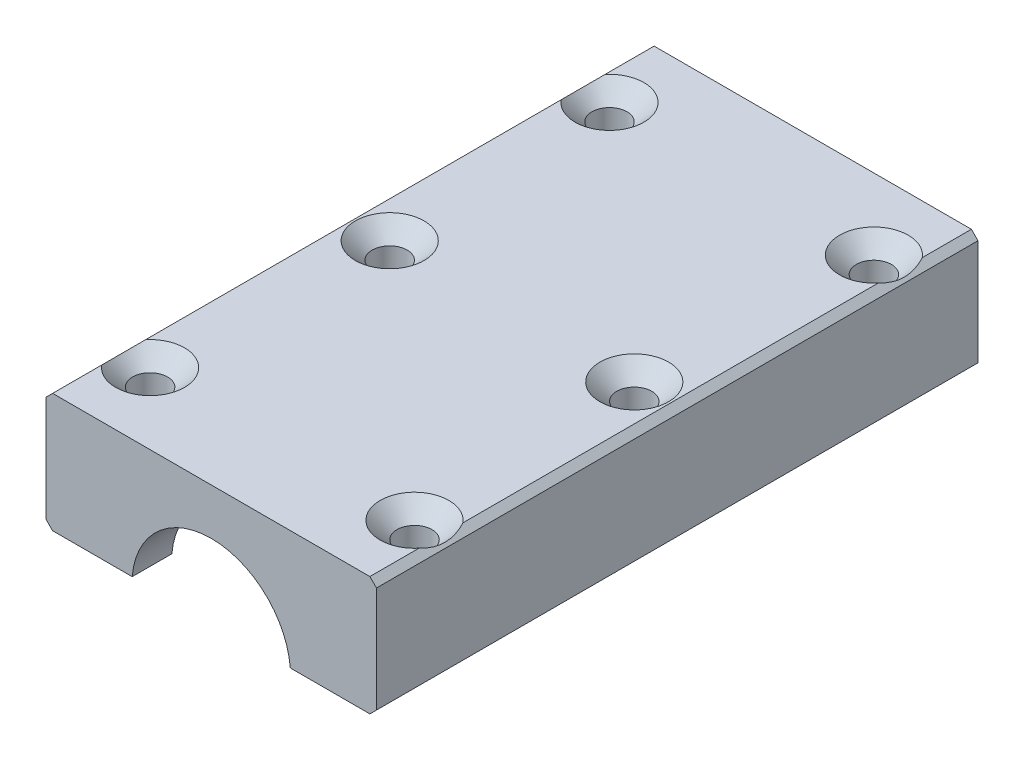
ISO-10303-21;
HEADER;
FILE_DESCRIPTION(('STEP AP214'),'2;1');
FILE_NAME('part.step','',(''),(''),'','','');
FILE_SCHEMA(('AUTOMOTIVE_DESIGN { 1 0 10303 214 1 1 1 1 }'));
ENDSEC;
DATA;
#1=APPLICATION_CONTEXT('core data for automotive mechanical design processes');
#2=APPLICATION_PROTOCOL_DEFINITION('international standard','automotive_design',2000,#1);
#3=PRODUCT_CONTEXT('',#1,'mechanical');
#4=PRODUCT('Part','Part','',(#3));
#5=PRODUCT_RELATED_PRODUCT_CATEGORY('part','',(#4));
#6=PRODUCT_DEFINITION_FORMATION('','',#4);
#7=PRODUCT_DEFINITION_CONTEXT('part definition',#1,'design');
#8=PRODUCT_DEFINITION('design','',#6,#7);
#9=PRODUCT_DEFINITION_SHAPE('','',#8);
#10=(LENGTH_UNIT() NAMED_UNIT(*) SI_UNIT(.MILLI.,.METRE.));
#11=(NAMED_UNIT(*) PLANE_ANGLE_UNIT() SI_UNIT($,.RADIAN.));
#12=(NAMED_UNIT(*) SI_UNIT($,.STERADIAN.) SOLID_ANGLE_UNIT());
#13=UNCERTAINTY_MEASURE_WITH_UNIT(LENGTH_MEASURE(1.E-05),#10,'distance_accuracy_value','');
#14=(GEOMETRIC_REPRESENTATION_CONTEXT(3) GLOBAL_UNCERTAINTY_ASSIGNED_CONTEXT((#13)) GLOBAL_UNIT_ASSIGNED_CONTEXT((#10,
#11,#12)) REPRESENTATION_CONTEXT('',''));
#15=CARTESIAN_POINT('',(0.,0.,0.));
#16=DIRECTION('',(0.,0.,1.));
#17=DIRECTION('',(1.,0.,0.));
#18=AXIS2_PLACEMENT_3D('',#15,#16,#17);
#19=CARTESIAN_POINT('',(11.9582607431014,1.,-91.));
#20=DIRECTION('',(0.,-1.,0.));
#21=DIRECTION('',(1.,0.,0.));
#22=AXIS2_PLACEMENT_3D('',#19,#20,#21);
#23=PLANE('',#22);
#24=CARTESIAN_POINT('',(20.,1.,-80.25));
#25=DIRECTION('',(0.,1.,0.));
#26=DIRECTION('',(0.,0.,1.));
#27=AXIS2_PLACEMENT_3D('',#24,#25,#26);
#28=CIRCLE('',#27,2.65);
#29=CARTESIAN_POINT('',(20.,1.,-77.6));
#30=VERTEX_POINT('',#29);
#31=EDGE_CURVE('E485',#30,#30,#28,.T.);
#32=ORIENTED_EDGE('',*,*,#31,.T.);
#33=EDGE_LOOP('',(#32));
#34=FACE_BOUND('',#33,.T.);
#35=CARTESIAN_POINT('',(18.5,1.,-45.5));
#36=DIRECTION('',(0.,1.,0.));
#37=DIRECTION('',(0.,0.,1.));
#38=AXIS2_PLACEMENT_3D('',#35,#36,#37);
#39=CIRCLE('',#38,2.65);
#40=CARTESIAN_POINT('',(18.5,1.,-42.85));
#41=VERTEX_POINT('',#40);
#42=EDGE_CURVE('E476',#41,#41,#39,.T.);
#43=ORIENTED_EDGE('',*,*,#42,.T.);
#44=EDGE_LOOP('',(#43));
#45=FACE_BOUND('',#44,.T.);
#46=CARTESIAN_POINT('',(20.,1.,-10.75));
#47=DIRECTION('',(0.,1.,0.));
#48=DIRECTION('',(0.,0.,1.));
#49=AXIS2_PLACEMENT_3D('',#46,#47,#48);
#50=CIRCLE('',#49,2.65);
#51=CARTESIAN_POINT('',(20.,1.,-8.1));
#52=VERTEX_POINT('',#51);
#53=EDGE_CURVE('E452',#52,#52,#50,.T.);
#54=ORIENTED_EDGE('',*,*,#53,.T.);
#55=EDGE_LOOP('',(#54));
#56=FACE_BOUND('',#55,.T.);
#57=DIRECTION('',(0.,0.,1.));
#58=VECTOR('',#57,1.);
#59=CARTESIAN_POINT('',(11.9582607431014,1.,-91.));
#60=LINE('',#59,#58);
#61=CARTESIAN_POINT('',(11.9582607431014,1.,-75.5));
#62=VERTEX_POINT('',#61);
#63=CARTESIAN_POINT('',(11.9582607431014,1.,-24.5));
#64=VERTEX_POINT('',#63);
#65=EDGE_CURVE('E377',#62,#64,#60,.T.);
#66=ORIENTED_EDGE('',*,*,#65,.F.);
#67=DIRECTION('',(1.,0.,0.));
#68=VECTOR('',#67,1.);
#69=CARTESIAN_POINT('',(11.9582607431014,1.,-75.5));
#70=LINE('',#69,#68);
#71=CARTESIAN_POINT('',(14.9666295470958,1.,-75.5));
#72=VERTEX_POINT('',#71);
#73=EDGE_CURVE('E432',#62,#72,#70,.T.);
#74=ORIENTED_EDGE('',*,*,#73,.T.);
#75=DIRECTION('',(0.,0.,1.));
#76=VECTOR('',#75,1.);
#77=CARTESIAN_POINT('',(14.9666295470958,1.,0.));
#78=LINE('',#77,#76);
#79=CARTESIAN_POINT('',(14.9666295470958,1.,-85.));
#80=VERTEX_POINT('',#79);
#81=EDGE_CURVE('E438',#72,#80,#78,.F.);
#82=ORIENTED_EDGE('',*,*,#81,.T.);
#83=DIRECTION('',(-1.,0.,0.));
#84=VECTOR('',#83,1.);
#85=CARTESIAN_POINT('',(11.9582607431014,1.,-85.));
#86=LINE('',#85,#84);
#87=CARTESIAN_POINT('',(11.9582607431014,1.,-85.));
#88=VERTEX_POINT('',#87);
#89=EDGE_CURVE('E441',#80,#88,#86,.T.);
#90=ORIENTED_EDGE('',*,*,#89,.T.);
#91=CARTESIAN_POINT('',(11.9582607431014,1.,-91.));
#92=VERTEX_POINT('',#91);
#93=EDGE_CURVE('E368',#92,#88,#60,.T.);
#94=ORIENTED_EDGE('',*,*,#93,.F.);
#95=DIRECTION('',(1.,0.,0.));
#96=VECTOR('',#95,1.);
#97=CARTESIAN_POINT('',(11.9582607431014,1.,-91.));
#98=LINE('',#97,#96);
#99=CARTESIAN_POINT('',(24.,0.999999999999998,-91.));
#100=VERTEX_POINT('',#99);
#101=EDGE_CURVE('E403',#92,#100,#98,.T.);
#102=ORIENTED_EDGE('',*,*,#101,.T.);
#103=DIRECTION('',(0.,0.,1.));
#104=VECTOR('',#103,1.);
#105=CARTESIAN_POINT('',(24.,1.,-91.));
#106=LINE('',#105,#104);
#107=CARTESIAN_POINT('',(24.,1.,0.));
#108=VERTEX_POINT('',#107);
#109=EDGE_CURVE('E217',#100,#108,#106,.T.);
#110=ORIENTED_EDGE('',*,*,#109,.T.);
#111=DIRECTION('',(1.,0.,0.));
#112=VECTOR('',#111,1.);
#113=CARTESIAN_POINT('',(11.9582607431014,1.,0.));
#114=LINE('',#113,#112);
#115=CARTESIAN_POINT('',(11.9582607431014,1.,0.));
#116=VERTEX_POINT('',#115);
#117=EDGE_CURVE('E385',#116,#108,#114,.T.);
#118=ORIENTED_EDGE('',*,*,#117,.F.);
#119=CARTESIAN_POINT('',(11.9582607431014,1.,-6.00000000000001));
#120=VERTEX_POINT('',#119);
#121=EDGE_CURVE('E372',#120,#116,#60,.T.);
#122=ORIENTED_EDGE('',*,*,#121,.F.);
#123=DIRECTION('',(1.,0.,0.));
#124=VECTOR('',#123,1.);
#125=CARTESIAN_POINT('',(11.9582607431014,1.,-6.00000000000001));
#126=LINE('',#125,#124);
#127=CARTESIAN_POINT('',(14.9666295470958,1.,-6.));
#128=VERTEX_POINT('',#127);
#129=EDGE_CURVE('E420',#120,#128,#126,.T.);
#130=ORIENTED_EDGE('',*,*,#129,.T.);
#131=DIRECTION('',(0.,0.,1.));
#132=VECTOR('',#131,1.);
#133=CARTESIAN_POINT('',(14.9666295470958,1.,0.));
#134=LINE('',#133,#132);
#135=CARTESIAN_POINT('',(14.9666295470958,1.,-24.5));
#136=VERTEX_POINT('',#135);
#137=EDGE_CURVE('E417',#128,#136,#134,.F.);
#138=ORIENTED_EDGE('',*,*,#137,.T.);
#139=DIRECTION('',(-1.,0.,0.));
#140=VECTOR('',#139,1.);
#141=CARTESIAN_POINT('',(11.9582607431014,1.,-24.5));
#142=LINE('',#141,#140);
#143=EDGE_CURVE('E397',#136,#64,#142,.T.);
#144=ORIENTED_EDGE('',*,*,#143,.T.);
#145=EDGE_LOOP('',(#66,#74,#82,#90,#94,#102,#110,#118,#122,#130,#138,#144));
#146=FACE_BOUND('',#145,.T.);
#147=ADVANCED_FACE('F36',(#34,#45,#56,#146),#23,.T.);
#148=CARTESIAN_POINT('',(0.,0.,-91.));
#149=DIRECTION('',(0.,0.,1.));
#150=DIRECTION('',(1.,0.,0.));
#151=AXIS2_PLACEMENT_3D('',#148,#149,#150);
#152=CYLINDRICAL_SURFACE('',#151,12.);
#153=DIRECTION('',(0.,0.,1.));
#154=VECTOR('',#153,1.);
#155=CARTESIAN_POINT('',(-11.9582607431014,1.,-91.));
#156=LINE('',#155,#154);
#157=CARTESIAN_POINT('',(-11.9582607431014,1.,-75.5));
#158=VERTEX_POINT('',#157);
#159=CARTESIAN_POINT('',(-11.9582607431014,1.,-24.5));
#160=VERTEX_POINT('',#159);
#161=EDGE_CURVE('E373',#158,#160,#156,.T.);
#162=ORIENTED_EDGE('',*,*,#161,.F.);
#163=CARTESIAN_POINT('',(0.,0.,-75.5));
#164=DIRECTION('',(0.,0.,-1.));
#165=DIRECTION('',(-1.,0.,0.));
#166=AXIS2_PLACEMENT_3D('',#163,#164,#165);
#167=CIRCLE('',#166,12.);
#168=EDGE_CURVE('E435',#158,#62,#167,.T.);
#169=ORIENTED_EDGE('',*,*,#168,.T.);
#170=ORIENTED_EDGE('',*,*,#65,.T.);
#171=CARTESIAN_POINT('',(0.,0.,-24.5));
#172=DIRECTION('',(0.,0.,1.));
#173=DIRECTION('',(1.,0.,0.));
#174=AXIS2_PLACEMENT_3D('',#171,#172,#173);
#175=CIRCLE('',#174,12.);
#176=EDGE_CURVE('E414',#64,#160,#175,.T.);
#177=ORIENTED_EDGE('',*,*,#176,.T.);
#178=EDGE_LOOP('',(#162,#169,#170,#177));
#179=FACE_BOUND('',#178,.T.);
#180=ADVANCED_FACE('F303',(#179),#152,.F.);
#181=ORIENTED_EDGE('',*,*,#93,.T.);
#182=CARTESIAN_POINT('',(0.,0.,-85.));
#183=DIRECTION('',(0.,0.,1.));
#184=DIRECTION('',(1.,0.,0.));
#185=AXIS2_PLACEMENT_3D('',#182,#183,#184);
#186=CIRCLE('',#185,12.);
#187=CARTESIAN_POINT('',(-11.9582607431014,1.,-85.));
#188=VERTEX_POINT('',#187);
#189=EDGE_CURVE('E444',#88,#188,#186,.T.);
#190=ORIENTED_EDGE('',*,*,#189,.T.);
#191=CARTESIAN_POINT('',(-11.9582607431014,1.,-91.));
#192=VERTEX_POINT('',#191);
#193=EDGE_CURVE('E369',#192,#188,#156,.T.);
#194=ORIENTED_EDGE('',*,*,#193,.F.);
#195=CARTESIAN_POINT('',(0.,0.,-91.));
#196=DIRECTION('',(0.,0.,-1.));
#197=DIRECTION('',(1.,0.,0.));
#198=AXIS2_PLACEMENT_3D('',#195,#196,#197);
#199=CIRCLE('',#198,12.);
#200=EDGE_CURVE('E406',#192,#92,#199,.T.);
#201=ORIENTED_EDGE('',*,*,#200,.T.);
#202=EDGE_LOOP('',(#181,#190,#194,#201));
#203=FACE_BOUND('',#202,.T.);
#204=ADVANCED_FACE('F307',(#203),#152,.F.);
#205=CARTESIAN_POINT('',(-25.,1.,-91.));
#206=DIRECTION('',(0.,-1.,0.));
#207=DIRECTION('',(1.,0.,0.));
#208=AXIS2_PLACEMENT_3D('',#205,#206,#207);
#209=PLANE('',#208);
#210=CARTESIAN_POINT('',(-20.,1.,-80.25));
#211=DIRECTION('',(0.,1.,0.));
#212=DIRECTION('',(0.,0.,1.));
#213=AXIS2_PLACEMENT_3D('',#210,#211,#212);
#214=CIRCLE('',#213,2.65);
#215=CARTESIAN_POINT('',(-20.,1.,-77.6));
#216=VERTEX_POINT('',#215);
#217=EDGE_CURVE('E492',#216,#216,#214,.T.);
#218=ORIENTED_EDGE('',*,*,#217,.T.);
#219=EDGE_LOOP('',(#218));
#220=FACE_BOUND('',#219,.T.);
#221=CARTESIAN_POINT('',(-18.5,1.,-45.5));
#222=DIRECTION('',(0.,1.,0.));
#223=DIRECTION('',(0.,0.,1.));
#224=AXIS2_PLACEMENT_3D('',#221,#222,#223);
#225=CIRCLE('',#224,2.65);
#226=CARTESIAN_POINT('',(-18.5,1.,-42.85));
#227=VERTEX_POINT('',#226);
#228=EDGE_CURVE('E467',#227,#227,#225,.T.);
#229=ORIENTED_EDGE('',*,*,#228,.T.);
#230=EDGE_LOOP('',(#229));
#231=FACE_BOUND('',#230,.T.);
#232=CARTESIAN_POINT('',(-20.,1.,-10.75));
#233=DIRECTION('',(0.,1.,0.));
#234=DIRECTION('',(0.,0.,1.));
#235=AXIS2_PLACEMENT_3D('',#232,#233,#234);
#236=CIRCLE('',#235,2.65);
#237=CARTESIAN_POINT('',(-20.,1.,-8.1));
#238=VERTEX_POINT('',#237);
#239=EDGE_CURVE('E459',#238,#238,#236,.T.);
#240=ORIENTED_EDGE('',*,*,#239,.T.);
#241=EDGE_LOOP('',(#240));
#242=FACE_BOUND('',#241,.T.);
#243=DIRECTION('',(0.,0.,1.));
#244=VECTOR('',#243,1.);
#245=CARTESIAN_POINT('',(-14.9666295470958,1.,0.));
#246=LINE('',#245,#244);
#247=CARTESIAN_POINT('',(-14.9666295470958,1.,-85.));
#248=VERTEX_POINT('',#247);
#249=CARTESIAN_POINT('',(-14.9666295470958,1.,-75.5));
#250=VERTEX_POINT('',#249);
#251=EDGE_CURVE('E232',#248,#250,#246,.T.);
#252=ORIENTED_EDGE('',*,*,#251,.T.);
#253=DIRECTION('',(1.,0.,0.));
#254=VECTOR('',#253,1.);
#255=CARTESIAN_POINT('',(-25.,1.,-75.5));
#256=LINE('',#255,#254);
#257=EDGE_CURVE('E235',#250,#158,#256,.T.);
#258=ORIENTED_EDGE('',*,*,#257,.T.);
#259=ORIENTED_EDGE('',*,*,#161,.T.);
#260=DIRECTION('',(-1.,0.,0.));
#261=VECTOR('',#260,1.);
#262=CARTESIAN_POINT('',(-25.,1.,-24.5));
#263=LINE('',#262,#261);
#264=CARTESIAN_POINT('',(-14.9666295470958,1.,-24.5));
#265=VERTEX_POINT('',#264);
#266=EDGE_CURVE('E226',#160,#265,#263,.T.);
#267=ORIENTED_EDGE('',*,*,#266,.T.);
#268=DIRECTION('',(0.,0.,1.));
#269=VECTOR('',#268,1.);
#270=CARTESIAN_POINT('',(-14.9666295470958,1.,0.));
#271=LINE('',#270,#269);
#272=CARTESIAN_POINT('',(-14.9666295470958,1.,-6.));
#273=VERTEX_POINT('',#272);
#274=EDGE_CURVE('E223',#265,#273,#271,.T.);
#275=ORIENTED_EDGE('',*,*,#274,.T.);
#276=DIRECTION('',(1.,0.,0.));
#277=VECTOR('',#276,1.);
#278=CARTESIAN_POINT('',(-25.,1.,-6.00000000000001));
#279=LINE('',#278,#277);
#280=CARTESIAN_POINT('',(-11.9582607431014,1.,-6.00000000000001));
#281=VERTEX_POINT('',#280);
#282=EDGE_CURVE('E220',#273,#281,#279,.T.);
#283=ORIENTED_EDGE('',*,*,#282,.T.);
#284=CARTESIAN_POINT('',(-11.9582607431014,1.,0.));
#285=VERTEX_POINT('',#284);
#286=EDGE_CURVE('E374',#281,#285,#156,.T.);
#287=ORIENTED_EDGE('',*,*,#286,.T.);
#288=DIRECTION('',(1.,0.,0.));
#289=VECTOR('',#288,1.);
#290=CARTESIAN_POINT('',(-25.,1.,0.));
#291=LINE('',#290,#289);
#292=CARTESIAN_POINT('',(-24.,1.,0.));
#293=VERTEX_POINT('',#292);
#294=EDGE_CURVE('E391',#293,#285,#291,.T.);
#295=ORIENTED_EDGE('',*,*,#294,.F.);
#296=DIRECTION('',(0.,0.,-1.));
#297=VECTOR('',#296,1.);
#298=CARTESIAN_POINT('',(-24.,1.,-91.));
#299=LINE('',#298,#297);
#300=CARTESIAN_POINT('',(-24.,1.,-91.));
#301=VERTEX_POINT('',#300);
#302=EDGE_CURVE('E353',#293,#301,#299,.T.);
#303=ORIENTED_EDGE('',*,*,#302,.T.);
#304=DIRECTION('',(1.,0.,0.));
#305=VECTOR('',#304,1.);
#306=CARTESIAN_POINT('',(-25.,1.,-91.));
#307=LINE('',#306,#305);
#308=EDGE_CURVE('E409',#301,#192,#307,.T.);
#309=ORIENTED_EDGE('',*,*,#308,.T.);
#310=ORIENTED_EDGE('',*,*,#193,.T.);
#311=DIRECTION('',(-1.,0.,0.));
#312=VECTOR('',#311,1.);
#313=CARTESIAN_POINT('',(-25.,1.,-85.));
#314=LINE('',#313,#312);
#315=EDGE_CURVE('E229',#188,#248,#314,.T.);
#316=ORIENTED_EDGE('',*,*,#315,.T.);
#317=EDGE_LOOP('',(#252,#258,#259,#267,#275,#283,#287,#295,#303,#309,#310,#316));
#318=FACE_BOUND('',#317,.T.);
#319=ADVANCED_FACE('F310',(#220,#231,#242,#318),#209,.T.);
#320=ORIENTED_EDGE('',*,*,#286,.F.);
#321=CARTESIAN_POINT('',(0.,0.,-6.00000000000001));
#322=DIRECTION('',(0.,0.,-1.));
#323=DIRECTION('',(-1.,0.,0.));
#324=AXIS2_PLACEMENT_3D('',#321,#322,#323);
#325=CIRCLE('',#324,12.);
#326=EDGE_CURVE('E423',#281,#120,#325,.T.);
#327=ORIENTED_EDGE('',*,*,#326,.T.);
#328=ORIENTED_EDGE('',*,*,#121,.T.);
#329=CARTESIAN_POINT('',(0.,0.,0.));
#330=DIRECTION('',(0.,0.,-1.));
#331=DIRECTION('',(1.,0.,0.));
#332=AXIS2_PLACEMENT_3D('',#329,#330,#331);
#333=CIRCLE('',#332,12.);
#334=EDGE_CURVE('E388',#285,#116,#333,.T.);
#335=ORIENTED_EDGE('',*,*,#334,.F.);
#336=EDGE_LOOP('',(#320,#327,#328,#335));
#337=FACE_BOUND('',#336,.T.);
#338=ADVANCED_FACE('F309',(#337),#152,.F.);
#339=CARTESIAN_POINT('',(-25.,1.,-91.));
#340=DIRECTION('',(-1.,0.,0.));
#341=DIRECTION('',(0.,0.,1.));
#342=AXIS2_PLACEMENT_3D('',#339,#340,#341);
#343=PLANE('',#342);
#344=DIRECTION('',(0.,-1.,0.));
#345=VECTOR('',#344,1.);
#346=CARTESIAN_POINT('',(-25.,1.,-91.));
#347=LINE('',#346,#345);
#348=CARTESIAN_POINT('',(-25.,18.,-91.));
#349=VERTEX_POINT('',#348);
#350=CARTESIAN_POINT('',(-25.,2.,-91.));
#351=VERTEX_POINT('',#350);
#352=EDGE_CURVE('E381',#349,#351,#347,.T.);
#353=ORIENTED_EDGE('',*,*,#352,.T.);
#354=DIRECTION('',(0.,0.,1.));
#355=VECTOR('',#354,1.);
#356=CARTESIAN_POINT('',(-25.,2.,-91.));
#357=LINE('',#356,#355);
#358=CARTESIAN_POINT('',(-25.,2.00000000000001,0.));
#359=VERTEX_POINT('',#358);
#360=EDGE_CURVE('E363',#351,#359,#357,.T.);
#361=ORIENTED_EDGE('',*,*,#360,.T.);
#362=DIRECTION('',(0.,-1.,0.));
#363=VECTOR('',#362,1.);
#364=CARTESIAN_POINT('',(-25.,1.,0.));
#365=LINE('',#364,#363);
#366=CARTESIAN_POINT('',(-25.,18.,0.));
#367=VERTEX_POINT('',#366);
#368=EDGE_CURVE('E394',#367,#359,#365,.T.);
#369=ORIENTED_EDGE('',*,*,#368,.F.);
#370=DIRECTION('',(0.,0.,-1.));
#371=VECTOR('',#370,1.);
#372=CARTESIAN_POINT('',(-25.,18.,-91.));
#373=LINE('',#372,#371);
#374=EDGE_CURVE('E366',#367,#349,#373,.T.);
#375=ORIENTED_EDGE('',*,*,#374,.T.);
#376=EDGE_LOOP('',(#353,#361,#369,#375));
#377=FACE_BOUND('',#376,.T.);
#378=ADVANCED_FACE('F297',(#377),#343,.T.);
#379=CARTESIAN_POINT('',(-25.,19.,-91.));
#380=DIRECTION('',(0.,1.,0.));
#381=DIRECTION('',(0.,0.,1.));
#382=AXIS2_PLACEMENT_3D('',#379,#380,#381);
#383=PLANE('',#382);
#384=CARTESIAN_POINT('',(-20.,19.,-80.25));
#385=DIRECTION('',(0.,1.,0.));
#386=DIRECTION('',(0.,0.,1.));
#387=AXIS2_PLACEMENT_3D('',#384,#385,#386);
#388=CIRCLE('',#387,5.2);
#389=CARTESIAN_POINT('',(-24.,19.,-76.9273504548328));
#390=VERTEX_POINT('',#389);
#391=CARTESIAN_POINT('',(-24.,19.,-83.5726495451672));
#392=VERTEX_POINT('',#391);
#393=EDGE_CURVE('E54',#390,#392,#388,.T.);
#394=ORIENTED_EDGE('',*,*,#393,.F.);
#395=DIRECTION('',(0.,0.,1.));
#396=VECTOR('',#395,1.);
#397=CARTESIAN_POINT('',(-24.,19.,-91.));
#398=LINE('',#397,#396);
#399=CARTESIAN_POINT('',(-24.,19.,-14.0726495451672));
#400=VERTEX_POINT('',#399);
#401=EDGE_CURVE('E196',#390,#400,#398,.T.);
#402=ORIENTED_EDGE('',*,*,#401,.T.);
#403=CARTESIAN_POINT('',(-20.,19.,-10.75));
#404=DIRECTION('',(0.,1.,0.));
#405=DIRECTION('',(0.,0.,1.));
#406=AXIS2_PLACEMENT_3D('',#403,#404,#405);
#407=CIRCLE('',#406,5.2);
#408=CARTESIAN_POINT('',(-24.,19.,-7.42735045483275));
#409=VERTEX_POINT('',#408);
#410=EDGE_CURVE('E465',#409,#400,#407,.T.);
#411=ORIENTED_EDGE('',*,*,#410,.F.);
#412=CARTESIAN_POINT('',(-24.,19.,0.));
#413=VERTEX_POINT('',#412);
#414=EDGE_CURVE('E206',#409,#413,#398,.T.);
#415=ORIENTED_EDGE('',*,*,#414,.T.);
#416=DIRECTION('',(-1.,0.,0.));
#417=VECTOR('',#416,1.);
#418=CARTESIAN_POINT('',(-25.,19.,0.));
#419=LINE('',#418,#417);
#420=CARTESIAN_POINT('',(24.,19.,0.));
#421=VERTEX_POINT('',#420);
#422=EDGE_CURVE('E378',#421,#413,#419,.T.);
#423=ORIENTED_EDGE('',*,*,#422,.F.);
#424=DIRECTION('',(0.,0.,-1.));
#425=VECTOR('',#424,1.);
#426=CARTESIAN_POINT('',(24.,19.,-91.));
#427=LINE('',#426,#425);
#428=CARTESIAN_POINT('',(24.,19.,-7.42735045483277));
#429=VERTEX_POINT('',#428);
#430=EDGE_CURVE('E209',#421,#429,#427,.T.);
#431=ORIENTED_EDGE('',*,*,#430,.T.);
#432=CARTESIAN_POINT('',(20.,19.,-10.75));
#433=DIRECTION('',(0.,1.,0.));
#434=DIRECTION('',(0.,0.,1.));
#435=AXIS2_PLACEMENT_3D('',#432,#433,#434);
#436=CIRCLE('',#435,5.2);
#437=CARTESIAN_POINT('',(24.,19.,-14.0726495451672));
#438=VERTEX_POINT('',#437);
#439=EDGE_CURVE('E339',#438,#429,#436,.T.);
#440=ORIENTED_EDGE('',*,*,#439,.F.);
#441=CARTESIAN_POINT('',(24.,19.,-76.9273504548328));
#442=VERTEX_POINT('',#441);
#443=EDGE_CURVE('E334',#438,#442,#427,.T.);
#444=ORIENTED_EDGE('',*,*,#443,.T.);
#445=CARTESIAN_POINT('',(20.,19.,-80.25));
#446=DIRECTION('',(0.,1.,0.));
#447=DIRECTION('',(0.,0.,1.));
#448=AXIS2_PLACEMENT_3D('',#445,#446,#447);
#449=CIRCLE('',#448,5.2);
#450=CARTESIAN_POINT('',(24.,19.,-83.5726495451672));
#451=VERTEX_POINT('',#450);
#452=EDGE_CURVE('E61',#451,#442,#449,.T.);
#453=ORIENTED_EDGE('',*,*,#452,.F.);
#454=CARTESIAN_POINT('',(24.,19.,-91.));
#455=VERTEX_POINT('',#454);
#456=EDGE_CURVE('E336',#451,#455,#427,.T.);
#457=ORIENTED_EDGE('',*,*,#456,.T.);
#458=DIRECTION('',(-1.,0.,0.));
#459=VECTOR('',#458,1.);
#460=CARTESIAN_POINT('',(-25.,19.,-91.));
#461=LINE('',#460,#459);
#462=CARTESIAN_POINT('',(-24.,19.,-91.));
#463=VERTEX_POINT('',#462);
#464=EDGE_CURVE('E398',#455,#463,#461,.T.);
#465=ORIENTED_EDGE('',*,*,#464,.T.);
#466=EDGE_CURVE('E199',#463,#392,#398,.T.);
#467=ORIENTED_EDGE('',*,*,#466,.T.);
#468=EDGE_LOOP('',(#394,#402,#411,#415,#423,#431,#440,#444,#453,#457,#465,#467));
#469=FACE_BOUND('',#468,.T.);
#470=CARTESIAN_POINT('',(18.5,19.,-45.5));
#471=DIRECTION('',(0.,1.,0.));
#472=DIRECTION('',(0.,0.,1.));
#473=AXIS2_PLACEMENT_3D('',#470,#471,#472);
#474=CIRCLE('',#473,5.2);
#475=CARTESIAN_POINT('',(18.5,19.,-40.3));
#476=VERTEX_POINT('',#475);
#477=EDGE_CURVE('E482',#476,#476,#474,.T.);
#478=ORIENTED_EDGE('',*,*,#477,.F.);
#479=EDGE_LOOP('',(#478));
#480=FACE_BOUND('',#479,.T.);
#481=CARTESIAN_POINT('',(-18.5,19.,-45.5));
#482=DIRECTION('',(0.,1.,0.));
#483=DIRECTION('',(0.,0.,1.));
#484=AXIS2_PLACEMENT_3D('',#481,#482,#483);
#485=CIRCLE('',#484,5.2);
#486=CARTESIAN_POINT('',(-18.5,19.,-40.3));
#487=VERTEX_POINT('',#486);
#488=EDGE_CURVE('E473',#487,#487,#485,.T.);
#489=ORIENTED_EDGE('',*,*,#488,.F.);
#490=EDGE_LOOP('',(#489));
#491=FACE_BOUND('',#490,.T.);
#492=ADVANCED_FACE('F193',(#469,#480,#491),#383,.T.);
#493=CARTESIAN_POINT('',(25.,1.,-91.));
#494=DIRECTION('',(1.,0.,0.));
#495=DIRECTION('',(0.,0.,-1.));
#496=AXIS2_PLACEMENT_3D('',#493,#494,#495);
#497=PLANE('',#496);
#498=DIRECTION('',(0.,1.,0.));
#499=VECTOR('',#498,1.);
#500=CARTESIAN_POINT('',(25.,1.,-91.));
#501=LINE('',#500,#499);
#502=CARTESIAN_POINT('',(25.,2.00000000000001,-91.));
#503=VERTEX_POINT('',#502);
#504=CARTESIAN_POINT('',(25.,18.,-91.));
#505=VERTEX_POINT('',#504);
#506=EDGE_CURVE('E400',#503,#505,#501,.T.);
#507=ORIENTED_EDGE('',*,*,#506,.T.);
#508=DIRECTION('',(0.,0.,1.));
#509=VECTOR('',#508,1.);
#510=CARTESIAN_POINT('',(25.,18.,-91.));
#511=LINE('',#510,#509);
#512=CARTESIAN_POINT('',(25.,18.,0.));
#513=VERTEX_POINT('',#512);
#514=EDGE_CURVE('E214',#505,#513,#511,.T.);
#515=ORIENTED_EDGE('',*,*,#514,.T.);
#516=DIRECTION('',(0.,1.,0.));
#517=VECTOR('',#516,1.);
#518=CARTESIAN_POINT('',(25.,1.,0.));
#519=LINE('',#518,#517);
#520=CARTESIAN_POINT('',(25.,2.00000000000001,0.));
#521=VERTEX_POINT('',#520);
#522=EDGE_CURVE('E382',#521,#513,#519,.T.);
#523=ORIENTED_EDGE('',*,*,#522,.F.);
#524=DIRECTION('',(0.,0.,-1.));
#525=VECTOR('',#524,1.);
#526=CARTESIAN_POINT('',(25.,2.00000000000001,-91.));
#527=LINE('',#526,#525);
#528=EDGE_CURVE('E208',#521,#503,#527,.T.);
#529=ORIENTED_EDGE('',*,*,#528,.T.);
#530=EDGE_LOOP('',(#507,#515,#523,#529));
#531=FACE_BOUND('',#530,.T.);
#532=ADVANCED_FACE('F289',(#531),#497,.T.);
#533=CARTESIAN_POINT('',(0.,0.,-91.));
#534=DIRECTION('',(0.,0.,1.));
#535=DIRECTION('',(1.,0.,0.));
#536=AXIS2_PLACEMENT_3D('',#533,#534,#535);
#537=PLANE('',#536);
#538=ORIENTED_EDGE('',*,*,#308,.F.);
#539=DIRECTION('',(0.707106781186548,-0.707106781186548,0.));
#540=VECTOR('',#539,1.);
#541=CARTESIAN_POINT('',(-25.,2.,-91.));
#542=LINE('',#541,#540);
#543=EDGE_CURVE('E340',#301,#351,#542,.F.);
#544=ORIENTED_EDGE('',*,*,#543,.T.);
#545=ORIENTED_EDGE('',*,*,#352,.F.);
#546=DIRECTION('',(-0.707106781186548,-0.707106781186548,0.));
#547=VECTOR('',#546,1.);
#548=CARTESIAN_POINT('',(-24.,19.,-91.));
#549=LINE('',#548,#547);
#550=EDGE_CURVE('E342',#349,#463,#549,.F.);
#551=ORIENTED_EDGE('',*,*,#550,.T.);
#552=ORIENTED_EDGE('',*,*,#464,.F.);
#553=DIRECTION('',(-0.707106781186548,0.707106781186548,0.));
#554=VECTOR('',#553,1.);
#555=CARTESIAN_POINT('',(25.,18.,-91.));
#556=LINE('',#555,#554);
#557=EDGE_CURVE('E347',#455,#505,#556,.F.);
#558=ORIENTED_EDGE('',*,*,#557,.T.);
#559=ORIENTED_EDGE('',*,*,#506,.F.);
#560=DIRECTION('',(0.707106781186548,0.707106781186548,0.));
#561=VECTOR('',#560,1.);
#562=CARTESIAN_POINT('',(24.,1.,-91.));
#563=LINE('',#562,#561);
#564=EDGE_CURVE('E351',#503,#100,#563,.F.);
#565=ORIENTED_EDGE('',*,*,#564,.T.);
#566=ORIENTED_EDGE('',*,*,#101,.F.);
#567=ORIENTED_EDGE('',*,*,#200,.F.);
#568=EDGE_LOOP('',(#538,#544,#545,#551,#552,#558,#559,#565,#566,#567));
#569=FACE_BOUND('',#568,.T.);
#570=ADVANCED_FACE('F285',(#569),#537,.F.);
#571=CARTESIAN_POINT('',(0.,0.,0.));
#572=DIRECTION('',(0.,0.,1.));
#573=DIRECTION('',(1.,0.,0.));
#574=AXIS2_PLACEMENT_3D('',#571,#572,#573);
#575=PLANE('',#574);
#576=ORIENTED_EDGE('',*,*,#368,.T.);
#577=DIRECTION('',(-0.707106781186548,0.707106781186548,0.));
#578=VECTOR('',#577,1.);
#579=CARTESIAN_POINT('',(-11.5,-11.5,0.));
#580=LINE('',#579,#578);
#581=EDGE_CURVE('E355',#359,#293,#580,.F.);
#582=ORIENTED_EDGE('',*,*,#581,.T.);
#583=ORIENTED_EDGE('',*,*,#294,.T.);
#584=ORIENTED_EDGE('',*,*,#334,.T.);
#585=ORIENTED_EDGE('',*,*,#117,.T.);
#586=DIRECTION('',(-0.707106781186548,-0.707106781186548,0.));
#587=VECTOR('',#586,1.);
#588=CARTESIAN_POINT('',(11.5,-11.5,0.));
#589=LINE('',#588,#587);
#590=EDGE_CURVE('E361',#108,#521,#589,.F.);
#591=ORIENTED_EDGE('',*,*,#590,.T.);
#592=ORIENTED_EDGE('',*,*,#522,.T.);
#593=DIRECTION('',(0.707106781186548,-0.707106781186548,0.));
#594=VECTOR('',#593,1.);
#595=CARTESIAN_POINT('',(21.5,21.5,0.));
#596=LINE('',#595,#594);
#597=EDGE_CURVE('E359',#513,#421,#596,.F.);
#598=ORIENTED_EDGE('',*,*,#597,.T.);
#599=ORIENTED_EDGE('',*,*,#422,.T.);
#600=DIRECTION('',(0.707106781186548,0.707106781186548,0.));
#601=VECTOR('',#600,1.);
#602=CARTESIAN_POINT('',(-21.5,21.5,0.));
#603=LINE('',#602,#601);
#604=EDGE_CURVE('E357',#413,#367,#603,.F.);
#605=ORIENTED_EDGE('',*,*,#604,.T.);
#606=EDGE_LOOP('',(#576,#582,#583,#584,#585,#591,#592,#598,#599,#605));
#607=FACE_BOUND('',#606,.T.);
#608=ADVANCED_FACE('F288',(#607),#575,.T.);
#609=CARTESIAN_POINT('',(-25.,2.,-91.));
#610=DIRECTION('',(0.707106781186547,0.707106781186547,0.));
#611=DIRECTION('',(0.,0.,1.));
#612=AXIS2_PLACEMENT_3D('',#609,#610,#611);
#613=PLANE('',#612);
#614=ORIENTED_EDGE('',*,*,#543,.F.);
#615=ORIENTED_EDGE('',*,*,#302,.F.);
#616=ORIENTED_EDGE('',*,*,#581,.F.);
#617=ORIENTED_EDGE('',*,*,#360,.F.);
#618=EDGE_LOOP('',(#614,#615,#616,#617));
#619=FACE_BOUND('',#618,.T.);
#620=ADVANCED_FACE('F293',(#619),#613,.F.);
#621=CARTESIAN_POINT('',(-24.,19.,-91.));
#622=DIRECTION('',(0.707106781186547,-0.707106781186547,0.));
#623=DIRECTION('',(0.,0.,1.));
#624=AXIS2_PLACEMENT_3D('',#621,#622,#623);
#625=PLANE('',#624);
#626=CARTESIAN_POINT('',(-23.9998,19.0002,-83.5732032739512));
#627=CARTESIAN_POINT('',(-24.0738793690361,18.9261206309639,-83.3682113699711));
#628=CARTESIAN_POINT('',(-24.1425317829403,18.8574682170597,-83.1590976948913));
#629=CARTESIAN_POINT('',(-24.2673630869593,18.7326369130407,-82.7331067115213));
#630=CARTESIAN_POINT('',(-24.3235176030809,18.6764823969191,-82.5162151741198));
#631=CARTESIAN_POINT('',(-24.4211803711222,18.5788196288778,-82.0770861593558));
#632=CARTESIAN_POINT('',(-24.4627628509931,18.5372371490069,-81.8548821219369));
#633=CARTESIAN_POINT('',(-24.5301250270952,18.4698749729048,-81.4058652730088));
#634=CARTESIAN_POINT('',(-24.5559169648024,18.4440830351976,-81.1790561728335));
#635=CARTESIAN_POINT('',(-24.5895375208206,18.4104624791794,-80.7378054388295));
#636=CARTESIAN_POINT('',(-24.5984319048694,18.4015680951306,-80.5235265922626));
#637=CARTESIAN_POINT('',(-24.601188081463,18.398811918537,-80.0947294958971));
#638=CARTESIAN_POINT('',(-24.5950469894216,18.4049530105784,-79.8802112080531));
#639=CARTESIAN_POINT('',(-24.567966807453,18.432033192547,-79.4531301973928));
#640=CARTESIAN_POINT('',(-24.5470321536535,18.4529678463465,-79.2405669076856));
#641=CARTESIAN_POINT('',(-24.4911619083291,18.5088380916709,-78.81925717573));
#642=CARTESIAN_POINT('',(-24.4562294701167,18.5437705298832,-78.6105098849096));
#643=CARTESIAN_POINT('',(-24.3635799322258,18.6364200677742,-78.1487095535304));
#644=CARTESIAN_POINT('',(-24.3024080825976,18.6975919174024,-77.8970334429657));
#645=CARTESIAN_POINT('',(-24.1979132447671,18.8020867552329,-77.5272060607633));
#646=CARTESIAN_POINT('',(-24.1609971025742,18.8390028974258,-77.4053159550247));
#647=CARTESIAN_POINT('',(-24.0832534616484,18.9167465383516,-77.1641208962216));
#648=CARTESIAN_POINT('',(-24.0424277695262,18.9575722304738,-77.0448147800451));
#649=CARTESIAN_POINT('',(-23.9998,19.0002,-76.9267967260488));
#650=B_SPLINE_CURVE_WITH_KNOTS('',3,(#626,#627,#628,#629,#630,#631,#632,#633,#634,#635,#636,
#637,#638,#639,#640,#641,#642,#643,#644,#645,#646,#647,#648,#649),.UNSPECIFIED.,.F.,.F.,(4,2,2,
2,2,2,2,2,2,2,2,4),(0.,0.690738207229877,1.38281194503549,2.07130728207738,2.75926819118247,
3.40217604850191,4.04520725864358,4.68804572555835,5.33073946013989,6.12752392700588,
6.52521237186752,6.92271792287334),.UNSPECIFIED.);
#651=EDGE_CURVE('E11',#392,#390,#650,.T.);
#652=ORIENTED_EDGE('',*,*,#651,.F.);
#653=ORIENTED_EDGE('',*,*,#466,.F.);
#654=ORIENTED_EDGE('',*,*,#550,.F.);
#655=ORIENTED_EDGE('',*,*,#374,.F.);
#656=ORIENTED_EDGE('',*,*,#604,.F.);
#657=ORIENTED_EDGE('',*,*,#414,.F.);
#658=CARTESIAN_POINT('',(-23.9998,19.0002,-14.0732032739512));
#659=CARTESIAN_POINT('',(-24.0738793690361,18.9261206309639,-13.8682113699711));
#660=CARTESIAN_POINT('',(-24.1425317829403,18.8574682170597,-13.6590976948913));
#661=CARTESIAN_POINT('',(-24.2673630869593,18.7326369130407,-13.2331067115213));
#662=CARTESIAN_POINT('',(-24.3235176030809,18.6764823969191,-13.0162151741198));
#663=CARTESIAN_POINT('',(-24.4211803711222,18.5788196288778,-12.5770861593558));
#664=CARTESIAN_POINT('',(-24.4627628509931,18.5372371490069,-12.3548821219369));
#665=CARTESIAN_POINT('',(-24.5301250270952,18.4698749729048,-11.9058652730088));
#666=CARTESIAN_POINT('',(-24.5559169648024,18.4440830351976,-11.6790561728335));
#667=CARTESIAN_POINT('',(-24.5895375208206,18.4104624791794,-11.2378054388294));
#668=CARTESIAN_POINT('',(-24.5984319048694,18.4015680951306,-11.0235265922626));
#669=CARTESIAN_POINT('',(-24.601188081463,18.398811918537,-10.5947294958971));
#670=CARTESIAN_POINT('',(-24.5950469894216,18.4049530105784,-10.3802112080531));
#671=CARTESIAN_POINT('',(-24.567966807453,18.432033192547,-9.95313019739279));
#672=CARTESIAN_POINT('',(-24.5470321536535,18.4529678463465,-9.74056690768565));
#673=CARTESIAN_POINT('',(-24.4911619083291,18.5088380916709,-9.31925717573002));
#674=CARTESIAN_POINT('',(-24.4562294701167,18.5437705298832,-9.11050988490959));
#675=CARTESIAN_POINT('',(-24.3635799322258,18.6364200677742,-8.64870955353038));
#676=CARTESIAN_POINT('',(-24.3024080825976,18.6975919174024,-8.39703344296568));
#677=CARTESIAN_POINT('',(-24.1979132447671,18.8020867552329,-8.02720606076336));
#678=CARTESIAN_POINT('',(-24.1609971025742,18.8390028974258,-7.90531595502473));
#679=CARTESIAN_POINT('',(-24.0832534616484,18.9167465383516,-7.66412089622158));
#680=CARTESIAN_POINT('',(-24.0424277695262,18.9575722304738,-7.5448147800451));
#681=CARTESIAN_POINT('',(-23.9998,19.0002,-7.42679672604878));
#682=B_SPLINE_CURVE_WITH_KNOTS('',3,(#658,#659,#660,#661,#662,#663,#664,#665,#666,#667,#668,
#669,#670,#671,#672,#673,#674,#675,#676,#677,#678,#679,#680,#681),.UNSPECIFIED.,.F.,.F.,(4,2,2,
2,2,2,2,2,2,2,2,4),(0.,0.690738207229885,1.3828119450355,2.07130728207736,2.75926819118247,
3.40217604850192,4.04520725864358,4.68804572555834,5.33073946013989,6.12752392700589,
6.52521237186751,6.92271792287334),.UNSPECIFIED.);
#683=EDGE_CURVE('E205',#400,#409,#682,.T.);
#684=ORIENTED_EDGE('',*,*,#683,.F.);
#685=ORIENTED_EDGE('',*,*,#401,.F.);
#686=EDGE_LOOP('',(#652,#653,#654,#655,#656,#657,#684,#685));
#687=FACE_BOUND('',#686,.T.);
#688=ADVANCED_FACE('F203',(#687),#625,.F.);
#689=CARTESIAN_POINT('',(25.,18.,-91.));
#690=DIRECTION('',(-0.707106781186547,-0.707106781186547,0.));
#691=DIRECTION('',(0.,0.,1.));
#692=AXIS2_PLACEMENT_3D('',#689,#690,#691);
#693=PLANE('',#692);
#694=CARTESIAN_POINT('',(23.9998,19.0002,-76.9267967260488));
#695=CARTESIAN_POINT('',(24.0738793690361,18.9261206309639,-77.1317886300289));
#696=CARTESIAN_POINT('',(24.1425317829403,18.8574682170597,-77.3409023051087));
#697=CARTESIAN_POINT('',(24.2673630869593,18.7326369130407,-77.7668932884787));
#698=CARTESIAN_POINT('',(24.3235176030809,18.6764823969191,-77.9837848258802));
#699=CARTESIAN_POINT('',(24.4211803711222,18.5788196288778,-78.4229138406442));
#700=CARTESIAN_POINT('',(24.4627628509931,18.5372371490069,-78.6451178780631));
#701=CARTESIAN_POINT('',(24.5301250270952,18.4698749729048,-79.0941347269912));
#702=CARTESIAN_POINT('',(24.5559169648024,18.4440830351976,-79.3209438271665));
#703=CARTESIAN_POINT('',(24.5895375208206,18.4104624791794,-79.7621945611706));
#704=CARTESIAN_POINT('',(24.5984319048694,18.4015680951306,-79.9764734077374));
#705=CARTESIAN_POINT('',(24.601188081463,18.398811918537,-80.4052705041029));
#706=CARTESIAN_POINT('',(24.5950469894216,18.4049530105784,-80.6197887919469));
#707=CARTESIAN_POINT('',(24.567966807453,18.432033192547,-81.0468698026072));
#708=CARTESIAN_POINT('',(24.5470321536535,18.4529678463465,-81.2594330923144));
#709=CARTESIAN_POINT('',(24.4911619083291,18.5088380916709,-81.68074282427));
#710=CARTESIAN_POINT('',(24.4562294701168,18.5437705298832,-81.8894901150904));
#711=CARTESIAN_POINT('',(24.3635799322258,18.6364200677742,-82.3512904464696));
#712=CARTESIAN_POINT('',(24.3024080825976,18.6975919174024,-82.6029665570343));
#713=CARTESIAN_POINT('',(24.1979132447671,18.8020867552329,-82.9727939392367));
#714=CARTESIAN_POINT('',(24.1609971025742,18.8390028974258,-83.0946840449753));
#715=CARTESIAN_POINT('',(24.0832534616484,18.9167465383516,-83.3358791037784));
#716=CARTESIAN_POINT('',(24.0424277695262,18.9575722304738,-83.4551852199549));
#717=CARTESIAN_POINT('',(23.9998,19.0002,-83.5732032739512));
#718=B_SPLINE_CURVE_WITH_KNOTS('',3,(#694,#695,#696,#697,#698,#699,#700,#701,#702,#703,#704,
#705,#706,#707,#708,#709,#710,#711,#712,#713,#714,#715,#716,#717),.UNSPECIFIED.,.F.,.F.,(4,2,2,
2,2,2,2,2,2,2,2,4),(0.,0.690738207229879,1.38281194503551,2.07130728207737,2.75926819118249,
3.40217604850197,4.0452072586436,4.68804572555836,5.3307394601399,6.12752392700591,
6.52521237186754,6.92271792287337),.UNSPECIFIED.);
#719=EDGE_CURVE('E49',#442,#451,#718,.T.);
#720=ORIENTED_EDGE('',*,*,#719,.F.);
#721=ORIENTED_EDGE('',*,*,#443,.F.);
#722=CARTESIAN_POINT('',(23.9998,19.0002,-7.42679672604876));
#723=CARTESIAN_POINT('',(24.0738793690361,18.9261206309639,-7.63178863002888));
#724=CARTESIAN_POINT('',(24.1425317829403,18.8574682170597,-7.84090230510872));
#725=CARTESIAN_POINT('',(24.2673630869593,18.7326369130407,-8.26689328847872));
#726=CARTESIAN_POINT('',(24.3235176030809,18.6764823969191,-8.48378482588019));
#727=CARTESIAN_POINT('',(24.4211803711222,18.5788196288778,-8.92291384064416));
#728=CARTESIAN_POINT('',(24.4627628509931,18.5372371490069,-9.14511787806313));
#729=CARTESIAN_POINT('',(24.5301250270952,18.4698749729048,-9.59413472699119));
#730=CARTESIAN_POINT('',(24.5559169648024,18.4440830351976,-9.82094382716645));
#731=CARTESIAN_POINT('',(24.5895375208206,18.4104624791794,-10.2621945611705));
#732=CARTESIAN_POINT('',(24.5984319048694,18.4015680951306,-10.4764734077374));
#733=CARTESIAN_POINT('',(24.601188081463,18.398811918537,-10.9052705041029));
#734=CARTESIAN_POINT('',(24.5950469894216,18.4049530105784,-11.1197887919469));
#735=CARTESIAN_POINT('',(24.567966807453,18.432033192547,-11.5468698026072));
#736=CARTESIAN_POINT('',(24.5470321536535,18.4529678463465,-11.7594330923143));
#737=CARTESIAN_POINT('',(24.4911619083291,18.5088380916709,-12.18074282427));
#738=CARTESIAN_POINT('',(24.4562294701168,18.5437705298832,-12.3894901150904));
#739=CARTESIAN_POINT('',(24.3635799322258,18.6364200677742,-12.8512904464696));
#740=CARTESIAN_POINT('',(24.3024080825976,18.6975919174024,-13.1029665570343));
#741=CARTESIAN_POINT('',(24.1979132447671,18.8020867552329,-13.4727939392367));
#742=CARTESIAN_POINT('',(24.1609971025742,18.8390028974258,-13.5946840449753));
#743=CARTESIAN_POINT('',(24.0832534616484,18.9167465383516,-13.8358791037784));
#744=CARTESIAN_POINT('',(24.0424277695262,18.9575722304738,-13.9551852199549));
#745=CARTESIAN_POINT('',(23.9998,19.0002,-14.0732032739512));
#746=B_SPLINE_CURVE_WITH_KNOTS('',3,(#722,#723,#724,#725,#726,#727,#728,#729,#730,#731,#732,
#733,#734,#735,#736,#737,#738,#739,#740,#741,#742,#743,#744,#745),.UNSPECIFIED.,.F.,.F.,(4,2,2,
2,2,2,2,2,2,2,2,4),(0.,0.690738207229884,1.3828119450355,2.07130728207737,2.75926819118248,
3.40217604850193,4.04520725864359,4.68804572555836,5.33073946013991,6.12752392700592,
6.52521237186754,6.92271792287338),.UNSPECIFIED.);
#747=EDGE_CURVE('E238',#429,#438,#746,.T.);
#748=ORIENTED_EDGE('',*,*,#747,.F.);
#749=ORIENTED_EDGE('',*,*,#430,.F.);
#750=ORIENTED_EDGE('',*,*,#597,.F.);
#751=ORIENTED_EDGE('',*,*,#514,.F.);
#752=ORIENTED_EDGE('',*,*,#557,.F.);
#753=ORIENTED_EDGE('',*,*,#456,.F.);
#754=EDGE_LOOP('',(#720,#721,#748,#749,#750,#751,#752,#753));
#755=FACE_BOUND('',#754,.T.);
#756=ADVANCED_FACE('F248',(#755),#693,.F.);
#757=CARTESIAN_POINT('',(24.,1.,-91.));
#758=DIRECTION('',(-0.707106781186547,0.707106781186547,0.));
#759=DIRECTION('',(0.,0.,1.));
#760=AXIS2_PLACEMENT_3D('',#757,#758,#759);
#761=PLANE('',#760);
#762=ORIENTED_EDGE('',*,*,#564,.F.);
#763=ORIENTED_EDGE('',*,*,#528,.F.);
#764=ORIENTED_EDGE('',*,*,#590,.F.);
#765=ORIENTED_EDGE('',*,*,#109,.F.);
#766=EDGE_LOOP('',(#762,#763,#764,#765));
#767=FACE_BOUND('',#766,.T.);
#768=ADVANCED_FACE('F38',(#767),#761,.F.);
#769=CARTESIAN_POINT('',(8.47514708453026,0.,-24.5));
#770=DIRECTION('',(0.,0.,1.));
#771=DIRECTION('',(1.,0.,0.));
#772=AXIS2_PLACEMENT_3D('',#769,#770,#771);
#773=PLANE('',#772);
#774=CARTESIAN_POINT('',(0.,0.,-24.5));
#775=DIRECTION('',(0.,0.,1.));
#776=DIRECTION('',(1.,0.,0.));
#777=AXIS2_PLACEMENT_3D('',#774,#775,#776);
#778=CIRCLE('',#777,15.);
#779=EDGE_CURVE('E426',#136,#265,#778,.T.);
#780=ORIENTED_EDGE('',*,*,#779,.T.);
#781=ORIENTED_EDGE('',*,*,#266,.F.);
#782=ORIENTED_EDGE('',*,*,#176,.F.);
#783=ORIENTED_EDGE('',*,*,#143,.F.);
#784=EDGE_LOOP('',(#780,#781,#782,#783));
#785=FACE_BOUND('',#784,.T.);
#786=ADVANCED_FACE('F280',(#785),#773,.T.);
#787=CARTESIAN_POINT('',(0.,0.,0.));
#788=DIRECTION('',(0.,0.,1.));
#789=DIRECTION('',(1.,0.,0.));
#790=AXIS2_PLACEMENT_3D('',#787,#788,#789);
#791=CYLINDRICAL_SURFACE('',#790,15.);
#792=CARTESIAN_POINT('',(0.,0.,-6.));
#793=DIRECTION('',(0.,0.,1.));
#794=DIRECTION('',(1.,0.,0.));
#795=AXIS2_PLACEMENT_3D('',#792,#793,#794);
#796=CIRCLE('',#795,15.);
#797=EDGE_CURVE('E429',#128,#273,#796,.T.);
#798=ORIENTED_EDGE('',*,*,#797,.T.);
#799=ORIENTED_EDGE('',*,*,#274,.F.);
#800=ORIENTED_EDGE('',*,*,#779,.F.);
#801=ORIENTED_EDGE('',*,*,#137,.F.);
#802=EDGE_LOOP('',(#798,#799,#800,#801));
#803=FACE_BOUND('',#802,.T.);
#804=ADVANCED_FACE('F276',(#803),#791,.F.);
#805=CARTESIAN_POINT('',(8.47514708453027,0.,-6.));
#806=DIRECTION('',(0.,0.,-1.));
#807=DIRECTION('',(-1.,0.,0.));
#808=AXIS2_PLACEMENT_3D('',#805,#806,#807);
#809=PLANE('',#808);
#810=ORIENTED_EDGE('',*,*,#326,.F.);
#811=ORIENTED_EDGE('',*,*,#282,.F.);
#812=ORIENTED_EDGE('',*,*,#797,.F.);
#813=ORIENTED_EDGE('',*,*,#129,.F.);
#814=EDGE_LOOP('',(#810,#811,#812,#813));
#815=FACE_BOUND('',#814,.T.);
#816=ADVANCED_FACE('F272',(#815),#809,.T.);
#817=CARTESIAN_POINT('',(9.86470460763676,0.,-75.5));
#818=DIRECTION('',(0.,0.,-1.));
#819=DIRECTION('',(-1.,0.,0.));
#820=AXIS2_PLACEMENT_3D('',#817,#818,#819);
#821=PLANE('',#820);
#822=ORIENTED_EDGE('',*,*,#168,.F.);
#823=ORIENTED_EDGE('',*,*,#257,.F.);
#824=CARTESIAN_POINT('',(0.,0.,-75.5));
#825=DIRECTION('',(0.,0.,1.));
#826=DIRECTION('',(1.,0.,0.));
#827=AXIS2_PLACEMENT_3D('',#824,#825,#826);
#828=CIRCLE('',#827,15.);
#829=EDGE_CURVE('E447',#72,#250,#828,.T.);
#830=ORIENTED_EDGE('',*,*,#829,.F.);
#831=ORIENTED_EDGE('',*,*,#73,.F.);
#832=EDGE_LOOP('',(#822,#823,#830,#831));
#833=FACE_BOUND('',#832,.T.);
#834=ADVANCED_FACE('F268',(#833),#821,.T.);
#835=CARTESIAN_POINT('',(0.,0.,0.));
#836=DIRECTION('',(0.,0.,1.));
#837=DIRECTION('',(1.,0.,0.));
#838=AXIS2_PLACEMENT_3D('',#835,#836,#837);
#839=CYLINDRICAL_SURFACE('',#838,15.);
#840=ORIENTED_EDGE('',*,*,#829,.T.);
#841=ORIENTED_EDGE('',*,*,#251,.F.);
#842=CARTESIAN_POINT('',(0.,0.,-85.));
#843=DIRECTION('',(0.,0.,1.));
#844=DIRECTION('',(1.,0.,0.));
#845=AXIS2_PLACEMENT_3D('',#842,#843,#844);
#846=CIRCLE('',#845,15.);
#847=EDGE_CURVE('E450',#80,#248,#846,.T.);
#848=ORIENTED_EDGE('',*,*,#847,.F.);
#849=ORIENTED_EDGE('',*,*,#81,.F.);
#850=EDGE_LOOP('',(#840,#841,#848,#849));
#851=FACE_BOUND('',#850,.T.);
#852=ADVANCED_FACE('F264',(#851),#839,.F.);
#853=CARTESIAN_POINT('',(9.86470460763679,0.,-85.));
#854=DIRECTION('',(0.,0.,1.));
#855=DIRECTION('',(1.,0.,0.));
#856=AXIS2_PLACEMENT_3D('',#853,#854,#855);
#857=PLANE('',#856);
#858=ORIENTED_EDGE('',*,*,#847,.T.);
#859=ORIENTED_EDGE('',*,*,#315,.F.);
#860=ORIENTED_EDGE('',*,*,#189,.F.);
#861=ORIENTED_EDGE('',*,*,#89,.F.);
#862=EDGE_LOOP('',(#858,#859,#860,#861));
#863=FACE_BOUND('',#862,.T.);
#864=ADVANCED_FACE('F260',(#863),#857,.T.);
#865=CARTESIAN_POINT('',(20.,19.,-10.75));
#866=DIRECTION('',(0.,1.,0.));
#867=DIRECTION('',(0.,0.,1.));
#868=AXIS2_PLACEMENT_3D('',#865,#866,#867);
#869=CYLINDRICAL_SURFACE('',#868,2.65);
#870=ORIENTED_EDGE('',*,*,#53,.F.);
#871=EDGE_LOOP('',(#870));
#872=FACE_BOUND('',#871,.T.);
#873=CARTESIAN_POINT('',(20.,16.45,-10.75));
#874=DIRECTION('',(0.,1.,0.));
#875=DIRECTION('',(0.,0.,1.));
#876=AXIS2_PLACEMENT_3D('',#873,#874,#875);
#877=CIRCLE('',#876,2.65);
#878=CARTESIAN_POINT('',(20.,16.45,-8.1));
#879=VERTEX_POINT('',#878);
#880=EDGE_CURVE('E455',#879,#879,#877,.T.);
#881=ORIENTED_EDGE('',*,*,#880,.T.);
#882=EDGE_LOOP('',(#881));
#883=FACE_BOUND('',#882,.T.);
#884=ADVANCED_FACE('F256',(#872,#883),#869,.F.);
#885=CARTESIAN_POINT('',(20.,19.,-10.75));
#886=DIRECTION('',(0.,1.,0.));
#887=DIRECTION('',(0.,0.,1.));
#888=AXIS2_PLACEMENT_3D('',#885,#886,#887);
#889=CONICAL_SURFACE('',#888,5.2,0.785398163397449);
#890=ORIENTED_EDGE('',*,*,#747,.T.);
#891=ORIENTED_EDGE('',*,*,#439,.T.);
#892=EDGE_LOOP('',(#890,#891));
#893=FACE_BOUND('',#892,.T.);
#894=ORIENTED_EDGE('',*,*,#880,.F.);
#895=EDGE_LOOP('',(#894));
#896=FACE_BOUND('',#895,.T.);
#897=ADVANCED_FACE('F250',(#893,#896),#889,.F.);
#898=CARTESIAN_POINT('',(-20.,19.,-10.75));
#899=DIRECTION('',(0.,1.,0.));
#900=DIRECTION('',(0.,0.,1.));
#901=AXIS2_PLACEMENT_3D('',#898,#899,#900);
#902=CYLINDRICAL_SURFACE('',#901,2.65);
#903=ORIENTED_EDGE('',*,*,#239,.F.);
#904=EDGE_LOOP('',(#903));
#905=FACE_BOUND('',#904,.T.);
#906=CARTESIAN_POINT('',(-20.,16.45,-10.75));
#907=DIRECTION('',(0.,1.,0.));
#908=DIRECTION('',(0.,0.,1.));
#909=AXIS2_PLACEMENT_3D('',#906,#907,#908);
#910=CIRCLE('',#909,2.65);
#911=CARTESIAN_POINT('',(-20.,16.45,-8.1));
#912=VERTEX_POINT('',#911);
#913=EDGE_CURVE('E462',#912,#912,#910,.T.);
#914=ORIENTED_EDGE('',*,*,#913,.T.);
#915=EDGE_LOOP('',(#914));
#916=FACE_BOUND('',#915,.T.);
#917=ADVANCED_FACE('F255',(#905,#916),#902,.F.);
#918=CARTESIAN_POINT('',(-20.,19.,-10.75));
#919=DIRECTION('',(0.,1.,0.));
#920=DIRECTION('',(0.,0.,1.));
#921=AXIS2_PLACEMENT_3D('',#918,#919,#920);
#922=CONICAL_SURFACE('',#921,5.2,0.785398163397449);
#923=ORIENTED_EDGE('',*,*,#683,.T.);
#924=ORIENTED_EDGE('',*,*,#410,.T.);
#925=EDGE_LOOP('',(#923,#924));
#926=FACE_BOUND('',#925,.T.);
#927=ORIENTED_EDGE('',*,*,#913,.F.);
#928=EDGE_LOOP('',(#927));
#929=FACE_BOUND('',#928,.T.);
#930=ADVANCED_FACE('F532',(#926,#929),#922,.F.);
#931=CARTESIAN_POINT('',(-18.5,19.,-45.5));
#932=DIRECTION('',(0.,1.,0.));
#933=DIRECTION('',(0.,0.,1.));
#934=AXIS2_PLACEMENT_3D('',#931,#932,#933);
#935=CYLINDRICAL_SURFACE('',#934,2.65);
#936=ORIENTED_EDGE('',*,*,#228,.F.);
#937=EDGE_LOOP('',(#936));
#938=FACE_BOUND('',#937,.T.);
#939=CARTESIAN_POINT('',(-18.5,16.45,-45.5));
#940=DIRECTION('',(0.,1.,0.));
#941=DIRECTION('',(0.,0.,1.));
#942=AXIS2_PLACEMENT_3D('',#939,#940,#941);
#943=CIRCLE('',#942,2.65);
#944=CARTESIAN_POINT('',(-18.5,16.45,-42.85));
#945=VERTEX_POINT('',#944);
#946=EDGE_CURVE('E470',#945,#945,#943,.T.);
#947=ORIENTED_EDGE('',*,*,#946,.T.);
#948=EDGE_LOOP('',(#947));
#949=FACE_BOUND('',#948,.T.);
#950=ADVANCED_FACE('F529',(#938,#949),#935,.F.);
#951=CARTESIAN_POINT('',(-18.5,19.,-45.5));
#952=DIRECTION('',(0.,1.,0.));
#953=DIRECTION('',(0.,0.,1.));
#954=AXIS2_PLACEMENT_3D('',#951,#952,#953);
#955=CONICAL_SURFACE('',#954,5.2,0.785398163397449);
#956=ORIENTED_EDGE('',*,*,#946,.F.);
#957=EDGE_LOOP('',(#956));
#958=FACE_BOUND('',#957,.T.);
#959=ORIENTED_EDGE('',*,*,#488,.T.);
#960=EDGE_LOOP('',(#959));
#961=FACE_BOUND('',#960,.T.);
#962=ADVANCED_FACE('F525',(#958,#961),#955,.F.);
#963=CARTESIAN_POINT('',(18.5,19.,-45.5));
#964=DIRECTION('',(0.,1.,0.));
#965=DIRECTION('',(0.,0.,1.));
#966=AXIS2_PLACEMENT_3D('',#963,#964,#965);
#967=CYLINDRICAL_SURFACE('',#966,2.65);
#968=ORIENTED_EDGE('',*,*,#42,.F.);
#969=EDGE_LOOP('',(#968));
#970=FACE_BOUND('',#969,.T.);
#971=CARTESIAN_POINT('',(18.5,16.45,-45.5));
#972=DIRECTION('',(0.,1.,0.));
#973=DIRECTION('',(0.,0.,1.));
#974=AXIS2_PLACEMENT_3D('',#971,#972,#973);
#975=CIRCLE('',#974,2.65);
#976=CARTESIAN_POINT('',(18.5,16.45,-42.85));
#977=VERTEX_POINT('',#976);
#978=EDGE_CURVE('E479',#977,#977,#975,.T.);
#979=ORIENTED_EDGE('',*,*,#978,.T.);
#980=EDGE_LOOP('',(#979));
#981=FACE_BOUND('',#980,.T.);
#982=ADVANCED_FACE('F521',(#970,#981),#967,.F.);
#983=CARTESIAN_POINT('',(18.5,19.,-45.5));
#984=DIRECTION('',(0.,1.,0.));
#985=DIRECTION('',(0.,0.,1.));
#986=AXIS2_PLACEMENT_3D('',#983,#984,#985);
#987=CONICAL_SURFACE('',#986,5.2,0.785398163397449);
#988=ORIENTED_EDGE('',*,*,#978,.F.);
#989=EDGE_LOOP('',(#988));
#990=FACE_BOUND('',#989,.T.);
#991=ORIENTED_EDGE('',*,*,#477,.T.);
#992=EDGE_LOOP('',(#991));
#993=FACE_BOUND('',#992,.T.);
#994=ADVANCED_FACE('F517',(#990,#993),#987,.F.);
#995=CARTESIAN_POINT('',(20.,19.,-80.25));
#996=DIRECTION('',(0.,1.,0.));
#997=DIRECTION('',(0.,0.,1.));
#998=AXIS2_PLACEMENT_3D('',#995,#996,#997);
#999=CYLINDRICAL_SURFACE('',#998,2.65);
#1000=ORIENTED_EDGE('',*,*,#31,.F.);
#1001=EDGE_LOOP('',(#1000));
#1002=FACE_BOUND('',#1001,.T.);
#1003=CARTESIAN_POINT('',(20.,16.45,-80.25));
#1004=DIRECTION('',(0.,1.,0.));
#1005=DIRECTION('',(0.,0.,1.));
#1006=AXIS2_PLACEMENT_3D('',#1003,#1004,#1005);
#1007=CIRCLE('',#1006,2.65);
#1008=CARTESIAN_POINT('',(20.,16.45,-77.6));
#1009=VERTEX_POINT('',#1008);
#1010=EDGE_CURVE('E488',#1009,#1009,#1007,.T.);
#1011=ORIENTED_EDGE('',*,*,#1010,.T.);
#1012=EDGE_LOOP('',(#1011));
#1013=FACE_BOUND('',#1012,.T.);
#1014=ADVANCED_FACE('F511',(#1002,#1013),#999,.F.);
#1015=CARTESIAN_POINT('',(20.,19.,-80.25));
#1016=DIRECTION('',(0.,1.,0.));
#1017=DIRECTION('',(0.,0.,1.));
#1018=AXIS2_PLACEMENT_3D('',#1015,#1016,#1017);
#1019=CONICAL_SURFACE('',#1018,5.2,0.785398163397449);
#1020=ORIENTED_EDGE('',*,*,#719,.T.);
#1021=ORIENTED_EDGE('',*,*,#452,.T.);
#1022=EDGE_LOOP('',(#1020,#1021));
#1023=FACE_BOUND('',#1022,.T.);
#1024=ORIENTED_EDGE('',*,*,#1010,.F.);
#1025=EDGE_LOOP('',(#1024));
#1026=FACE_BOUND('',#1025,.T.);
#1027=ADVANCED_FACE('F503',(#1023,#1026),#1019,.F.);
#1028=CARTESIAN_POINT('',(-20.,19.,-80.25));
#1029=DIRECTION('',(0.,1.,0.));
#1030=DIRECTION('',(0.,0.,1.));
#1031=AXIS2_PLACEMENT_3D('',#1028,#1029,#1030);
#1032=CYLINDRICAL_SURFACE('',#1031,2.65);
#1033=ORIENTED_EDGE('',*,*,#217,.F.);
#1034=EDGE_LOOP('',(#1033));
#1035=FACE_BOUND('',#1034,.T.);
#1036=CARTESIAN_POINT('',(-20.,16.45,-80.25));
#1037=DIRECTION('',(0.,1.,0.));
#1038=DIRECTION('',(0.,0.,1.));
#1039=AXIS2_PLACEMENT_3D('',#1036,#1037,#1038);
#1040=CIRCLE('',#1039,2.65);
#1041=CARTESIAN_POINT('',(-20.,16.45,-77.6));
#1042=VERTEX_POINT('',#1041);
#1043=EDGE_CURVE('E200',#1042,#1042,#1040,.T.);
#1044=ORIENTED_EDGE('',*,*,#1043,.T.);
#1045=EDGE_LOOP('',(#1044));
#1046=FACE_BOUND('',#1045,.T.);
#1047=ADVANCED_FACE('F498',(#1035,#1046),#1032,.F.);
#1048=CARTESIAN_POINT('',(-20.,19.,-80.25));
#1049=DIRECTION('',(0.,1.,0.));
#1050=DIRECTION('',(0.,0.,1.));
#1051=AXIS2_PLACEMENT_3D('',#1048,#1049,#1050);
#1052=CONICAL_SURFACE('',#1051,5.2,0.785398163397449);
#1053=ORIENTED_EDGE('',*,*,#651,.T.);
#1054=ORIENTED_EDGE('',*,*,#393,.T.);
#1055=EDGE_LOOP('',(#1053,#1054));
#1056=FACE_BOUND('',#1055,.T.);
#1057=ORIENTED_EDGE('',*,*,#1043,.F.);
#1058=EDGE_LOOP('',(#1057));
#1059=FACE_BOUND('',#1058,.T.);
#1060=ADVANCED_FACE('F186',(#1056,#1059),#1052,.F.);
#1061=CLOSED_SHELL('',(#147,#180,#204,#319,#338,#378,#492,#532,#570,#608,#620,#688,#756,#768,
#786,#804,#816,#834,#852,#864,#884,#897,#917,#930,#950,#962,#982,#994,#1014,#1027,#1047,#1060));
#1062=MANIFOLD_SOLID_BREP('B2',#1061);
#1063=ADVANCED_BREP_SHAPE_REPRESENTATION('',(#18,#1062),#14);
#1064=SHAPE_DEFINITION_REPRESENTATION(#9,#1063);
ENDSEC;
END-ISO-10303-21;
